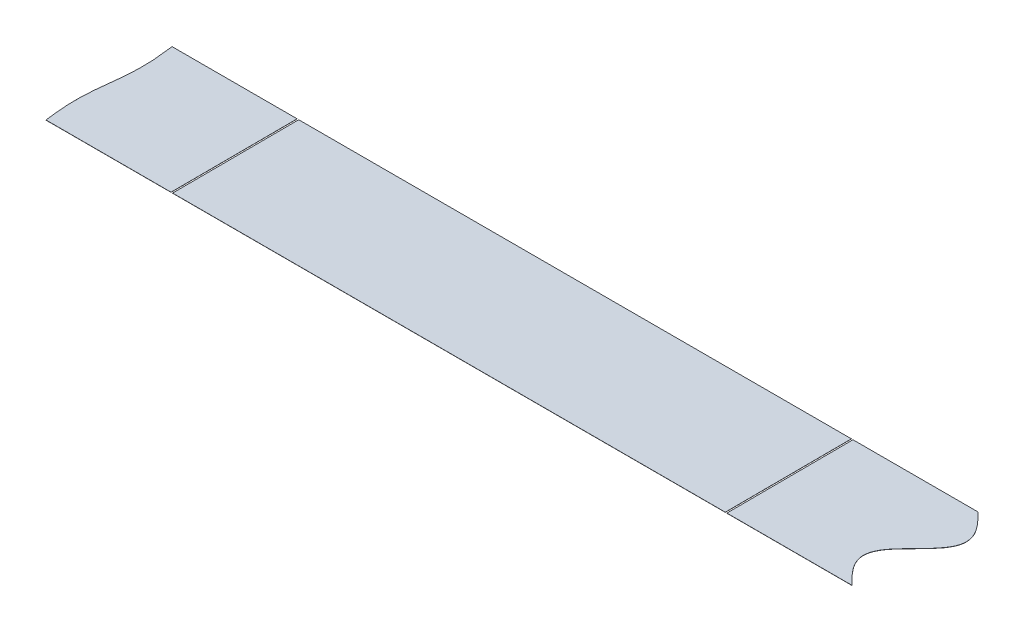
ISO-10303-21;
HEADER;
FILE_DESCRIPTION(('STEP AP214'),'2;1');
FILE_NAME('part.step','',(''),(''),'','','');
FILE_SCHEMA(('AUTOMOTIVE_DESIGN { 1 0 10303 214 1 1 1 1 }'));
ENDSEC;
DATA;
#1=APPLICATION_CONTEXT('core data for automotive mechanical design processes');
#2=APPLICATION_PROTOCOL_DEFINITION('international standard','automotive_design',2000,#1);
#3=PRODUCT_CONTEXT('',#1,'mechanical');
#4=PRODUCT('Part','Part','',(#3));
#5=PRODUCT_RELATED_PRODUCT_CATEGORY('part','',(#4));
#6=PRODUCT_DEFINITION_FORMATION('','',#4);
#7=PRODUCT_DEFINITION_CONTEXT('part definition',#1,'design');
#8=PRODUCT_DEFINITION('design','',#6,#7);
#9=PRODUCT_DEFINITION_SHAPE('','',#8);
#10=(LENGTH_UNIT() NAMED_UNIT(*) SI_UNIT(.MILLI.,.METRE.));
#11=(NAMED_UNIT(*) PLANE_ANGLE_UNIT() SI_UNIT($,.RADIAN.));
#12=(NAMED_UNIT(*) SI_UNIT($,.STERADIAN.) SOLID_ANGLE_UNIT());
#13=UNCERTAINTY_MEASURE_WITH_UNIT(LENGTH_MEASURE(1.E-05),#10,'distance_accuracy_value','');
#14=(GEOMETRIC_REPRESENTATION_CONTEXT(3) GLOBAL_UNCERTAINTY_ASSIGNED_CONTEXT((#13)) GLOBAL_UNIT_ASSIGNED_CONTEXT((#10,
#11,#12)) REPRESENTATION_CONTEXT('',''));
#15=CARTESIAN_POINT('',(0.,0.,0.));
#16=DIRECTION('',(0.,0.,1.));
#17=DIRECTION('',(1.,0.,0.));
#18=AXIS2_PLACEMENT_3D('',#15,#16,#17);
#19=CARTESIAN_POINT('',(7958.49039614374,401.836568244569,-4899.10644549594));
#20=DIRECTION('',(0.,0.999992126449225,0.00396825396825354));
#21=DIRECTION('',(0.,-0.00396825396825354,0.999992126449225));
#22=AXIS2_PLACEMENT_3D('',#19,#20,#21);
#23=PLANE('',#22);
#24=DIRECTION('',(0.,0.00396825396825362,-0.999992126449225));
#25=VECTOR('',#24,1.);
#26=CARTESIAN_POINT('',(2805.32798019281,381.699900005905,175.293996783698));
#27=LINE('',#26,#25);
#28=CARTESIAN_POINT('',(2805.32798019281,381.384892477941,254.675268813232));
#29=VERTEX_POINT('',#28);
#30=CARTESIAN_POINT('',(2805.32798019281,381.699900005905,175.293996783698));
#31=VERTEX_POINT('',#30);
#32=EDGE_CURVE('E14',#29,#31,#27,.T.);
#33=ORIENTED_EDGE('',*,*,#32,.F.);
#34=DIRECTION('',(-1.,0.,0.));
#35=VECTOR('',#34,1.);
#36=CARTESIAN_POINT('',(2883.95,381.384892477941,254.675268813232));
#37=LINE('',#36,#35);
#38=CARTESIAN_POINT('',(2883.95,381.384892477941,254.675268813232));
#39=VERTEX_POINT('',#38);
#40=EDGE_CURVE('E101',#39,#29,#37,.T.);
#41=ORIENTED_EDGE('',*,*,#40,.F.);
#42=CARTESIAN_POINT('',(2883.95,381.384892477941,254.675268813234));
#43=CARTESIAN_POINT('',(2883.55257564203,381.386475829465,254.276267370747));
#44=CARTESIAN_POINT('',(2883.33259255253,381.387353474253,254.055102625502));
#45=CARTESIAN_POINT('',(2882.99174945316,381.388713302277,253.712428661748));
#46=CARTESIAN_POINT('',(2882.38983360873,381.391123868475,253.104970762552));
#47=CARTESIAN_POINT('',(2881.78469414821,381.393562508902,252.490438213568));
#48=CARTESIAN_POINT('',(2881.18241221287,381.396010836879,251.873464421111));
#49=CARTESIAN_POINT('',(2880.58574930101,381.398463644581,251.255361747005));
#50=CARTESIAN_POINT('',(2879.9966565405,381.400918889008,250.636645022883));
#51=CARTESIAN_POINT('',(2879.41679462217,381.40337560637,250.017557122294));
#52=CARTESIAN_POINT('',(2878.84768882765,381.405833280432,249.398228134871));
#53=CARTESIAN_POINT('',(2878.29078382996,381.4082916109,248.778733734704));
#54=CARTESIAN_POINT('',(2877.4647372046,381.412029908794,247.836690082726));
#55=CARTESIAN_POINT('',(2876.44237493674,381.416939167796,246.599566554878));
#56=CARTESIAN_POINT('',(2875.49168991331,381.421851392,245.36169580179));
#57=CARTESIAN_POINT('',(2874.62209555102,381.426765518505,244.123345672821));
#58=CARTESIAN_POINT('',(2873.84211033941,381.431680925561,242.884672847575));
#59=CARTESIAN_POINT('',(2873.15932988044,381.436597223579,241.645775501689));
#60=CARTESIAN_POINT('',(2872.5803802896,381.441514152066,240.406719278881));
#61=CARTESIAN_POINT('',(2872.11086794387,381.446431527843,239.167550339685));
#62=CARTESIAN_POINT('',(2871.7553332312,381.451349215359,237.928302843083));
#63=CARTESIAN_POINT('',(2871.51721134919,381.45626710782,236.689003700585));
#64=CARTESIAN_POINT('',(2871.39880176862,381.4611851165,235.449675271261));
#65=CARTESIAN_POINT('',(2871.40124761538,381.466103162161,234.210337522822));
#66=CARTESIAN_POINT('',(2871.52452528862,381.471021167921,232.971009829249));
#67=CARTESIAN_POINT('',(2871.76744465254,381.475939053993,231.731712296829));
#68=CARTESIAN_POINT('',(2872.1276598483,381.480856730982,230.492467452854));
#69=CARTESIAN_POINT('',(2872.60169038202,381.485774091596,229.253302334983));
#70=CARTESIAN_POINT('',(2873.18495197861,381.490690998663,228.014251509896));
#71=CARTESIAN_POINT('',(2873.87179606582,381.495607266279,226.775361825264));
#72=CARTESIAN_POINT('',(2874.65555641018,381.500522630288,225.536699847697));
#73=CARTESIAN_POINT('',(2875.52859924595,381.505436694016,224.298365538339));
#74=CARTESIAN_POINT('',(2876.48236961234,381.51034882316,223.060518740289));
#75=CARTESIAN_POINT('',(2877.50741793725,381.515257929834,221.823433598835));
#76=CARTESIAN_POINT('',(2878.33531145958,381.518996632526,220.881287938635));
#77=CARTESIAN_POINT('',(2878.89325478949,381.521454917765,220.261804935868));
#78=CARTESIAN_POINT('',(2879.46328438493,381.523912527015,219.642492281146));
#79=CARTESIAN_POINT('',(2880.04395037151,381.526369148317,219.023428587266));
#80=CARTESIAN_POINT('',(2880.63371934904,381.528824241006,218.404750101033));
#81=CARTESIAN_POINT('',(2881.23091471381,381.531276784631,217.786713973566));
#82=CARTESIAN_POINT('',(2881.83354799713,381.533724593164,217.169871080034));
#83=CARTESIAN_POINT('',(2882.43873791292,381.536161986025,216.555652915144));
#84=CARTESIAN_POINT('',(2883.03978867811,381.538568130556,215.949309267544));
#85=CARTESIAN_POINT('',(2883.5196063682,381.540482024532,215.467011783078));
#86=CARTESIAN_POINT('',(2883.79407188063,381.54157582409,215.191376464671));
#87=CARTESIAN_POINT('',(2884.20587846356,381.543216461928,214.777938984717));
#88=CARTESIAN_POINT('',(2884.48032488711,381.544310185254,214.5023228765));
#89=CARTESIAN_POINT('',(2884.96014399032,381.546224084349,214.020024102206));
#90=CARTESIAN_POINT('',(2885.56119254847,381.54863021872,213.413683014635));
#91=CARTESIAN_POINT('',(2886.16638266252,381.551067610333,212.7994651643));
#92=CARTESIAN_POINT('',(2886.76901695397,381.553515420245,212.182621923431));
#93=CARTESIAN_POINT('',(2887.36621296051,381.555967963085,211.564585993827));
#94=CARTESIAN_POINT('',(2887.95598267922,381.558423054693,210.94590777972));
#95=CARTESIAN_POINT('',(2888.53664981512,381.560879675933,210.326844101692));
#96=CARTESIAN_POINT('',(2889.10668086557,381.563337285764,209.707531300309));
#97=CARTESIAN_POINT('',(2889.66462563815,381.565795570877,209.08804832949));
#98=CARTESIAN_POINT('',(2890.49252173042,381.569534274,208.145902560522));
#99=CARTESIAN_POINT('',(2891.51757381741,381.574443380382,206.908817492688));
#100=CARTESIAN_POINT('',(2892.47134843065,381.579355508856,205.670970863626));
#101=CARTESIAN_POINT('',(2893.34439612496,381.584269572406,204.432636598994));
#102=CARTESIAN_POINT('',(2894.12816185949,381.58918493672,203.193974544659));
#103=CARTESIAN_POINT('',(2894.81501170623,381.594101204485,201.955084822412));
#104=CARTESIAN_POINT('',(2895.39827935469,381.599018111242,200.716034075494));
#105=CARTESIAN_POINT('',(2895.87231627679,381.60393547182,199.476868966495));
#106=CARTESIAN_POINT('',(2896.2325381032,381.608853149089,198.237624052067));
#107=CARTESIAN_POINT('',(2896.47546424256,381.613771035197,196.998326510772));
#108=CARTESIAN_POINT('',(2896.59874878406,381.618689040699,195.758998882143));
#109=CARTESIAN_POINT('',(2896.59999999916,381.62119785213,195.126783379276));
#110=CARTESIAN_POINT('',(2896.60000003873,381.623703634443,194.495331208398));
#111=CARTESIAN_POINT('',(2896.47946141937,381.628615423202,193.257570186557));
#112=CARTESIAN_POINT('',(2896.239544813,381.633527094968,192.019838646977));
#113=CARTESIAN_POINT('',(2895.88256116492,381.638438561022,190.782158946528));
#114=CARTESIAN_POINT('',(2895.4119509296,381.643349715105,189.544557861854));
#115=CARTESIAN_POINT('',(2894.83225358092,381.648260422016,188.307069463756));
#116=CARTESIAN_POINT('',(2894.14906858858,381.65317049868,187.069739886676));
#117=CARTESIAN_POINT('',(2893.36900924114,381.658079685281,185.832634603757));
#118=CARTESIAN_POINT('',(2892.4996528331,381.662987592355,184.595851759245));
#119=CARTESIAN_POINT('',(2891.54949413842,381.667893599561,183.359547677288));
#120=CARTESIAN_POINT('',(2890.52791793694,381.672796645766,182.123989762065));
#121=CARTESIAN_POINT('',(2889.70264097854,381.676530223398,181.18313560676));
#122=CARTESIAN_POINT('',(2889.14629439731,381.67898544115,180.564425604603));
#123=CARTESIAN_POINT('',(2888.57779269112,381.68144000252,179.945881009492));
#124=CARTESIAN_POINT('',(2887.99857532044,381.683893608502,179.327577170563));
#125=CARTESIAN_POINT('',(2887.41016194525,381.686345745056,178.709643624284));
#126=CARTESIAN_POINT('',(2886.81420830317,381.688795447175,178.092323550658));
#127=CARTESIAN_POINT('',(2886.21265937371,381.691240675138,177.476130955669));
#128=CARTESIAN_POINT('',(2885.60826891301,381.693676230259,176.862375897813));
#129=CARTESIAN_POINT('',(2885.00710529599,381.696083754725,176.25568450903));
#130=CARTESIAN_POINT('',(2884.66662621499,381.697442126394,175.913377543671));
#131=CARTESIAN_POINT('',(2884.4469524093,381.69831853464,175.692524404705));
#132=CARTESIAN_POINT('',(2884.05,381.699900005905,175.293996783699));
#133=B_SPLINE_CURVE_WITH_KNOTS('',2,(#42,#43,#44,#45,#46,#47,#48,#49,#50,#51,#52,#53,#54,#55,
#56,#57,#58,#59,#60,#61,#62,#63,#64,#65,#66,#67,#68,#69,#70,#71,#72,#73,#74,#75,#76,#77,#78,#79,
#80,#81,#82,#83,#84,#85,#86,#87,#88,#89,#90,#91,#92,#93,#94,#95,#96,#97,#98,#99,#100,#101,#102,
#103,#104,#105,#106,#107,#108,#109,#110,#111,#112,#113,#114,#115,#116,#117,#118,#119,#120,#121,
#122,#123,#124,#125,#126,#127,#128,#129,#130,#131,#132),.UNSPECIFIED.,.F.,.F.,(3,2,1,1,1,1,1,1,
1,1,1,1,1,1,1,1,1,1,1,1,1,1,1,1,1,1,1,1,1,1,1,1,1,1,1,1,1,1,1,1,1,1,1,1,1,1,1,1,1,1,1,1,1,1,1,1,
1,1,1,1,1,1,1,1,1,1,1,1,1,1,1,1,1,1,1,1,1,1,1,1,1,1,1,1,1,1,2,3),(0.,0.0078125,0.015625,
0.0234375,0.03125,0.0390625,0.046875,0.0546875,0.0625,0.0703125,0.078125,0.09375,0.109375,0.125,
0.140625,0.15625,0.171875,0.1875,0.203125,0.21875,0.234375,0.25,0.265625,0.28125,0.296875,
0.3125,0.328125,0.34375,0.359375,0.375,0.390625,0.40625,0.421875,0.4296875,0.4375,0.4453125,
0.453125,0.4609375,0.46875,0.4765625,0.484375,0.4921875,0.49609375,0.5,0.50390625,0.5078125,
0.515625,0.5234375,0.53125,0.5390625,0.546875,0.5546875,0.5625,0.5703125,0.578125,0.59375,
0.609375,0.625,0.640625,0.65625,0.671875,0.6875,0.703125,0.71875,0.734375,0.75,
0.750316619873047,0.765921831130981,0.781527042388916,0.797132253646851,0.812737464904785,
0.82834267616272,0.843947887420654,0.859553098678589,0.875158309936523,0.890763521194458,
0.906368732452393,0.921973943710327,0.929776549339294,0.937579154968262,0.945381760597229,
0.953184366226196,0.960986971855164,0.968789577484131,0.976592183113098,0.984394788742065,
0.992197394371033,1.),.UNSPECIFIED.);
#134=CARTESIAN_POINT('',(2884.05,381.699900005905,175.293996783698));
#135=VERTEX_POINT('',#134);
#136=EDGE_CURVE('E122',#39,#135,#133,.T.);
#137=ORIENTED_EDGE('',*,*,#136,.T.);
#138=DIRECTION('',(-1.,0.,0.));
#139=VECTOR('',#138,1.);
#140=CARTESIAN_POINT('',(2884.05,381.699900005905,175.293996783698));
#141=LINE('',#140,#139);
#142=EDGE_CURVE('E103',#135,#31,#141,.T.);
#143=ORIENTED_EDGE('',*,*,#142,.T.);
#144=EDGE_LOOP('',(#33,#41,#137,#143));
#145=FACE_BOUND('',#144,.T.);
#146=ADVANCED_FACE('F55',(#145),#23,.T.);
#147=CARTESIAN_POINT('',(7958.49039614374,401.736569031924,-4899.10684232133));
#148=DIRECTION('',(0.,0.999992126449225,0.00396825396825354));
#149=DIRECTION('',(0.,-0.00396825396825354,0.999992126449225));
#150=AXIS2_PLACEMENT_3D('',#147,#148,#149);
#151=PLANE('',#150);
#152=DIRECTION('',(-1.,0.,0.));
#153=VECTOR('',#152,1.);
#154=CARTESIAN_POINT('',(2883.95,381.284893265296,254.674871987835));
#155=LINE('',#154,#153);
#156=CARTESIAN_POINT('',(2883.95,381.284893265296,254.674871987835));
#157=VERTEX_POINT('',#156);
#158=CARTESIAN_POINT('',(2805.32798019281,381.284893265296,254.674871987835));
#159=VERTEX_POINT('',#158);
#160=EDGE_CURVE('E58',#157,#159,#155,.T.);
#161=ORIENTED_EDGE('',*,*,#160,.T.);
#162=DIRECTION('',(0.,0.00396825396825354,-0.999992126449225));
#163=VECTOR('',#162,1.);
#164=CARTESIAN_POINT('',(2805.32798019281,401.736569031924,-4899.10684232133));
#165=LINE('',#164,#163);
#166=CARTESIAN_POINT('',(2805.32798019281,381.59990079326,175.293599958301));
#167=VERTEX_POINT('',#166);
#168=EDGE_CURVE('E73',#159,#167,#165,.T.);
#169=ORIENTED_EDGE('',*,*,#168,.T.);
#170=DIRECTION('',(-1.,0.,0.));
#171=VECTOR('',#170,1.);
#172=CARTESIAN_POINT('',(2884.05,381.59990079326,175.293599958301));
#173=LINE('',#172,#171);
#174=CARTESIAN_POINT('',(2884.05,381.59990079326,175.293599958301));
#175=VERTEX_POINT('',#174);
#176=EDGE_CURVE('E114',#175,#167,#173,.T.);
#177=ORIENTED_EDGE('',*,*,#176,.F.);
#178=CARTESIAN_POINT('',(2883.95,381.284893265296,254.674871987837));
#179=CARTESIAN_POINT('',(2883.55257564203,381.28647661682,254.27587054535));
#180=CARTESIAN_POINT('',(2883.33259255253,381.287354261608,254.054705800105));
#181=CARTESIAN_POINT('',(2882.99174945316,381.288714089632,253.712031836351));
#182=CARTESIAN_POINT('',(2882.38983360873,381.29112465583,253.104573937155));
#183=CARTESIAN_POINT('',(2881.78469414821,381.293563296257,252.490041388171));
#184=CARTESIAN_POINT('',(2881.18241221287,381.296011624234,251.873067595715));
#185=CARTESIAN_POINT('',(2880.58574930101,381.298464431936,251.254964921608));
#186=CARTESIAN_POINT('',(2879.9966565405,381.300919676363,250.636248197486));
#187=CARTESIAN_POINT('',(2879.41679462217,381.303376393725,250.017160296897));
#188=CARTESIAN_POINT('',(2878.84768882765,381.305834067787,249.397831309474));
#189=CARTESIAN_POINT('',(2878.29078382996,381.308292398255,248.778336909307));
#190=CARTESIAN_POINT('',(2877.4647372046,381.312030696149,247.836293257329));
#191=CARTESIAN_POINT('',(2876.44237493674,381.316939955151,246.599169729481));
#192=CARTESIAN_POINT('',(2875.49168991331,381.321852179355,245.361298976393));
#193=CARTESIAN_POINT('',(2874.62209555102,381.32676630586,244.122948847424));
#194=CARTESIAN_POINT('',(2873.84211033941,381.331681712916,242.884276022179));
#195=CARTESIAN_POINT('',(2873.15932988044,381.336598010934,241.645378676292));
#196=CARTESIAN_POINT('',(2872.5803802896,381.341514939421,240.406322453484));
#197=CARTESIAN_POINT('',(2872.11086794387,381.346432315198,239.167153514289));
#198=CARTESIAN_POINT('',(2871.7553332312,381.351350002714,237.927906017687));
#199=CARTESIAN_POINT('',(2871.51721134919,381.356267895175,236.688606875188));
#200=CARTESIAN_POINT('',(2871.39880176862,381.361185903855,235.449278445864));
#201=CARTESIAN_POINT('',(2871.40124761538,381.366103949516,234.209940697425));
#202=CARTESIAN_POINT('',(2871.52452528862,381.371021955276,232.970613003852));
#203=CARTESIAN_POINT('',(2871.76744465254,381.375939841348,231.731315471432));
#204=CARTESIAN_POINT('',(2872.1276598483,381.380857518337,230.492070627457));
#205=CARTESIAN_POINT('',(2872.60169038202,381.385774878951,229.252905509586));
#206=CARTESIAN_POINT('',(2873.18495197861,381.390691786018,228.013854684499));
#207=CARTESIAN_POINT('',(2873.87179606582,381.395608053634,226.774964999867));
#208=CARTESIAN_POINT('',(2874.65555641018,381.400523417643,225.536303022301));
#209=CARTESIAN_POINT('',(2875.52859924595,381.405437481371,224.297968712942));
#210=CARTESIAN_POINT('',(2876.48236961234,381.410349610515,223.060121914892));
#211=CARTESIAN_POINT('',(2877.50741793725,381.415258717189,221.823036773438));
#212=CARTESIAN_POINT('',(2878.33531145958,381.418997419881,220.880891113239));
#213=CARTESIAN_POINT('',(2878.89325478949,381.42145570512,220.261408110471));
#214=CARTESIAN_POINT('',(2879.46328438493,381.42391331437,219.642095455749));
#215=CARTESIAN_POINT('',(2880.04395037151,381.426369935672,219.02303176187));
#216=CARTESIAN_POINT('',(2880.63371934904,381.428825028361,218.404353275636));
#217=CARTESIAN_POINT('',(2881.23091471381,381.431277571986,217.786317148169));
#218=CARTESIAN_POINT('',(2881.83354799713,381.433725380519,217.169474254638));
#219=CARTESIAN_POINT('',(2882.43873791292,381.43616277338,216.555256089747));
#220=CARTESIAN_POINT('',(2883.03978867811,381.438568917911,215.948912442147));
#221=CARTESIAN_POINT('',(2883.5196063682,381.440482811887,215.466614957681));
#222=CARTESIAN_POINT('',(2883.79407188063,381.441576611445,215.190979639274));
#223=CARTESIAN_POINT('',(2884.20587846356,381.443217249283,214.77754215932));
#224=CARTESIAN_POINT('',(2884.48032488711,381.44431097261,214.501926051104));
#225=CARTESIAN_POINT('',(2884.96014399032,381.446224871704,214.01962727681));
#226=CARTESIAN_POINT('',(2885.56119254847,381.448631006075,213.413286189239));
#227=CARTESIAN_POINT('',(2886.16638266252,381.451068397688,212.799068338903));
#228=CARTESIAN_POINT('',(2886.76901695397,381.4535162076,212.182225098034));
#229=CARTESIAN_POINT('',(2887.36621296051,381.45596875044,211.56418916843));
#230=CARTESIAN_POINT('',(2887.95598267922,381.458423842048,210.945510954323));
#231=CARTESIAN_POINT('',(2888.53664981512,381.460880463288,210.326447276295));
#232=CARTESIAN_POINT('',(2889.10668086557,381.46333807312,209.707134474912));
#233=CARTESIAN_POINT('',(2889.66462563815,381.465796358232,209.087651504094));
#234=CARTESIAN_POINT('',(2890.49252173042,381.469535061355,208.145505735125));
#235=CARTESIAN_POINT('',(2891.51757381741,381.474444167737,206.908420667292));
#236=CARTESIAN_POINT('',(2892.47134843065,381.479356296211,205.670574038229));
#237=CARTESIAN_POINT('',(2893.34439612496,381.484270359762,204.432239773597));
#238=CARTESIAN_POINT('',(2894.12816185949,381.489185724075,203.193577719262));
#239=CARTESIAN_POINT('',(2894.81501170623,381.49410199184,201.954687997016));
#240=CARTESIAN_POINT('',(2895.39827935469,381.499018898597,200.715637250097));
#241=CARTESIAN_POINT('',(2895.87231627679,381.503936259175,199.476472141098));
#242=CARTESIAN_POINT('',(2896.2325381032,381.508853936444,198.23722722667));
#243=CARTESIAN_POINT('',(2896.47546424256,381.513771822552,196.997929685375));
#244=CARTESIAN_POINT('',(2896.59874878406,381.518689828054,195.758602056746));
#245=CARTESIAN_POINT('',(2896.59999999916,381.521198639485,195.126386553879));
#246=CARTESIAN_POINT('',(2896.60000003873,381.523704421798,194.494934383001));
#247=CARTESIAN_POINT('',(2896.47946141937,381.528616210558,193.25717336116));
#248=CARTESIAN_POINT('',(2896.239544813,381.533527882323,192.01944182158));
#249=CARTESIAN_POINT('',(2895.88256116492,381.538439348377,190.781762121131));
#250=CARTESIAN_POINT('',(2895.4119509296,381.54335050246,189.544161036457));
#251=CARTESIAN_POINT('',(2894.83225358092,381.548261209372,188.306672638359));
#252=CARTESIAN_POINT('',(2894.14906858858,381.553171286036,187.069343061279));
#253=CARTESIAN_POINT('',(2893.36900924114,381.558080472636,185.83223777836));
#254=CARTESIAN_POINT('',(2892.4996528331,381.56298837971,184.595454933849));
#255=CARTESIAN_POINT('',(2891.54949413842,381.567894386917,183.359150851891));
#256=CARTESIAN_POINT('',(2890.52791793694,381.572797433121,182.123592936668));
#257=CARTESIAN_POINT('',(2889.70264097854,381.576531010753,181.182738781363));
#258=CARTESIAN_POINT('',(2889.14629439731,381.578986228505,180.564028779206));
#259=CARTESIAN_POINT('',(2888.57779269112,381.581440789876,179.945484184096));
#260=CARTESIAN_POINT('',(2887.99857532044,381.583894395857,179.327180345166));
#261=CARTESIAN_POINT('',(2887.41016194525,381.586346532411,178.709246798888));
#262=CARTESIAN_POINT('',(2886.81420830317,381.58879623453,178.091926725261));
#263=CARTESIAN_POINT('',(2886.21265937371,381.591241462493,177.475734130272));
#264=CARTESIAN_POINT('',(2885.60826891301,381.593677017614,176.861979072417));
#265=CARTESIAN_POINT('',(2885.00710529599,381.596084542081,176.255287683633));
#266=CARTESIAN_POINT('',(2884.66662621499,381.597442913749,175.912980718274));
#267=CARTESIAN_POINT('',(2884.4469524093,381.598319321995,175.692127579309));
#268=CARTESIAN_POINT('',(2884.05,381.59990079326,175.293599958303));
#269=B_SPLINE_CURVE_WITH_KNOTS('',2,(#178,#179,#180,#181,#182,#183,#184,#185,#186,#187,#188,
#189,#190,#191,#192,#193,#194,#195,#196,#197,#198,#199,#200,#201,#202,#203,#204,#205,#206,#207,
#208,#209,#210,#211,#212,#213,#214,#215,#216,#217,#218,#219,#220,#221,#222,#223,#224,#225,#226,
#227,#228,#229,#230,#231,#232,#233,#234,#235,#236,#237,#238,#239,#240,#241,#242,#243,#244,#245,
#246,#247,#248,#249,#250,#251,#252,#253,#254,#255,#256,#257,#258,#259,#260,#261,#262,#263,#264,
#265,#266,#267,#268),.UNSPECIFIED.,.F.,.F.,(3,2,1,1,1,1,1,1,1,1,1,1,1,1,1,1,1,1,1,1,1,1,1,1,1,1,
1,1,1,1,1,1,1,1,1,1,1,1,1,1,1,1,1,1,1,1,1,1,1,1,1,1,1,1,1,1,1,1,1,1,1,1,1,1,1,1,1,1,1,1,1,1,1,1,
1,1,1,1,1,1,1,1,1,1,1,1,2,3),(0.,0.0078125,0.015625,0.0234375,0.03125,0.0390625,0.046875,
0.0546875,0.0625,0.0703125,0.078125,0.09375,0.109375,0.125,0.140625,0.15625,0.171875,0.1875,
0.203125,0.21875,0.234375,0.25,0.265625,0.28125,0.296875,0.3125,0.328125,0.34375,0.359375,0.375,
0.390625,0.40625,0.421875,0.4296875,0.4375,0.4453125,0.453125,0.4609375,0.46875,0.4765625,
0.484375,0.4921875,0.49609375,0.5,0.50390625,0.5078125,0.515625,0.5234375,0.53125,0.5390625,
0.546875,0.5546875,0.5625,0.5703125,0.578125,0.59375,0.609375,0.625,0.640625,0.65625,0.671875,
0.6875,0.703125,0.71875,0.734375,0.75,0.750316619873047,0.765921831130981,0.781527042388916,
0.797132253646851,0.812737464904785,0.82834267616272,0.843947887420654,0.859553098678589,
0.875158309936523,0.890763521194458,0.906368732452393,0.921973943710327,0.929776549339294,
0.937579154968262,0.945381760597229,0.953184366226196,0.960986971855164,0.968789577484131,
0.976592183113098,0.984394788742065,0.992197394371033,1.),.UNSPECIFIED.);
#270=EDGE_CURVE('E106',#157,#175,#269,.T.);
#271=ORIENTED_EDGE('',*,*,#270,.F.);
#272=EDGE_LOOP('',(#161,#169,#177,#271));
#273=FACE_BOUND('',#272,.T.);
#274=ADVANCED_FACE('F142',(#273),#151,.F.);
#275=CARTESIAN_POINT('',(2884.05,381.699900005905,175.293996783698));
#276=DIRECTION('',(0.,-0.00396825396825353,0.999992126449225));
#277=DIRECTION('',(0.,-0.999992126449225,-0.00396825396825353));
#278=AXIS2_PLACEMENT_3D('',#275,#276,#277);
#279=PLANE('',#278);
#280=ORIENTED_EDGE('',*,*,#176,.T.);
#281=DIRECTION('',(0.,0.999992126449225,0.00396825396825354));
#282=VECTOR('',#281,1.);
#283=CARTESIAN_POINT('',(2805.32798019281,371.699978741413,175.254314244016));
#284=LINE('',#283,#282);
#285=EDGE_CURVE('E111',#167,#31,#284,.T.);
#286=ORIENTED_EDGE('',*,*,#285,.T.);
#287=ORIENTED_EDGE('',*,*,#142,.F.);
#288=DIRECTION('',(0.,-0.999992126449225,-0.00396825396825353));
#289=VECTOR('',#288,1.);
#290=CARTESIAN_POINT('',(2884.05,381.699900005905,175.293996783698));
#291=LINE('',#290,#289);
#292=EDGE_CURVE('E107',#135,#175,#291,.T.);
#293=ORIENTED_EDGE('',*,*,#292,.T.);
#294=EDGE_LOOP('',(#280,#286,#287,#293));
#295=FACE_BOUND('',#294,.T.);
#296=ADVANCED_FACE('F140',(#295),#279,.F.);
#297=CARTESIAN_POINT('',(2883.95,381.384892477941,254.675268813232));
#298=DIRECTION('',(0.,-0.00396825396825353,0.999992126449225));
#299=DIRECTION('',(0.,-0.999992126449225,-0.00396825396825353));
#300=AXIS2_PLACEMENT_3D('',#297,#298,#299);
#301=PLANE('',#300);
#302=DIRECTION('',(0.,0.999992126449225,0.00396825396825353));
#303=VECTOR('',#302,1.);
#304=CARTESIAN_POINT('',(2805.32798019281,381.384892477941,254.675268813232));
#305=LINE('',#304,#303);
#306=EDGE_CURVE('E64',#159,#29,#305,.T.);
#307=ORIENTED_EDGE('',*,*,#306,.F.);
#308=ORIENTED_EDGE('',*,*,#160,.F.);
#309=DIRECTION('',(0.,-0.999992126449225,-0.00396825396825353));
#310=VECTOR('',#309,1.);
#311=CARTESIAN_POINT('',(2883.95,381.384892477941,254.675268813232));
#312=LINE('',#311,#310);
#313=EDGE_CURVE('E96',#39,#157,#312,.T.);
#314=ORIENTED_EDGE('',*,*,#313,.F.);
#315=ORIENTED_EDGE('',*,*,#40,.T.);
#316=EDGE_LOOP('',(#307,#308,#314,#315));
#317=FACE_BOUND('',#316,.T.);
#318=ADVANCED_FACE('F104',(#317),#301,.T.);
#319=DIRECTION('',(0.,-0.999992126449225,-0.00396825396825353));
#320=VECTOR('',#319,1.);
#321=SURFACE_OF_LINEAR_EXTRUSION('',#133,#320);
#322=ORIENTED_EDGE('',*,*,#270,.T.);
#323=ORIENTED_EDGE('',*,*,#292,.F.);
#324=ORIENTED_EDGE('',*,*,#136,.F.);
#325=ORIENTED_EDGE('',*,*,#313,.T.);
#326=EDGE_LOOP('',(#322,#323,#324,#325));
#327=FACE_BOUND('',#326,.T.);
#328=ADVANCED_FACE('F132',(#327),#321,.F.);
#329=CARTESIAN_POINT('',(2805.32798019281,371.699978741413,175.254314244016));
#330=DIRECTION('',(1.,0.,0.));
#331=DIRECTION('',(0.,0.,-1.));
#332=AXIS2_PLACEMENT_3D('',#329,#330,#331);
#333=PLANE('',#332);
#334=ORIENTED_EDGE('',*,*,#306,.T.);
#335=ORIENTED_EDGE('',*,*,#32,.T.);
#336=ORIENTED_EDGE('',*,*,#285,.F.);
#337=ORIENTED_EDGE('',*,*,#168,.F.);
#338=EDGE_LOOP('',(#334,#335,#336,#337));
#339=FACE_BOUND('',#338,.T.);
#340=ADVANCED_FACE('F91',(#339),#333,.F.);
#341=CLOSED_SHELL('',(#146,#274,#296,#318,#328,#340));
#342=MANIFOLD_SOLID_BREP('B2',#341);
#343=CARTESIAN_POINT('',(2883.95,381.384892477941,254.675268813232));
#344=DIRECTION('',(0.,-0.00396825396825353,0.999992126449225));
#345=DIRECTION('',(0.,-0.999992126449225,-0.00396825396825353));
#346=AXIS2_PLACEMENT_3D('',#343,#344,#345);
#347=PLANE('',#346);
#348=DIRECTION('',(0.,0.999992126449225,0.00396825396825354));
#349=VECTOR('',#348,1.);
#350=CARTESIAN_POINT('',(2455.32798019281,371.384971213449,254.63558627355));
#351=LINE('',#350,#349);
#352=CARTESIAN_POINT('',(2455.32798019281,381.284893265296,254.674871987835));
#353=VERTEX_POINT('',#352);
#354=CARTESIAN_POINT('',(2455.32798019281,381.384892477941,254.675268813232));
#355=VERTEX_POINT('',#354);
#356=EDGE_CURVE('E247',#353,#355,#351,.T.);
#357=ORIENTED_EDGE('',*,*,#356,.T.);
#358=DIRECTION('',(-1.,0.,0.));
#359=VECTOR('',#358,1.);
#360=CARTESIAN_POINT('',(2883.95,381.384892477941,254.675268813232));
#361=LINE('',#360,#359);
#362=CARTESIAN_POINT('',(2376.59403961437,381.384892477941,254.675268813234));
#363=VERTEX_POINT('',#362);
#364=EDGE_CURVE('E242',#355,#363,#361,.T.);
#365=ORIENTED_EDGE('',*,*,#364,.T.);
#366=DIRECTION('',(0.,-0.999992126449225,-0.00396825396825353));
#367=VECTOR('',#366,1.);
#368=CARTESIAN_POINT('',(2376.59403961437,381.384892477941,254.675268813234));
#369=LINE('',#368,#367);
#370=CARTESIAN_POINT('',(2376.59403961437,381.284893265296,254.674871987837));
#371=VERTEX_POINT('',#370);
#372=EDGE_CURVE('E245',#363,#371,#369,.T.);
#373=ORIENTED_EDGE('',*,*,#372,.T.);
#374=DIRECTION('',(-1.,0.,0.));
#375=VECTOR('',#374,1.);
#376=CARTESIAN_POINT('',(2883.95,381.284893265296,254.674871987835));
#377=LINE('',#376,#375);
#378=EDGE_CURVE('E203',#353,#371,#377,.T.);
#379=ORIENTED_EDGE('',*,*,#378,.F.);
#380=EDGE_LOOP('',(#357,#365,#373,#379));
#381=FACE_BOUND('',#380,.T.);
#382=ADVANCED_FACE('F200',(#381),#347,.T.);
#383=CARTESIAN_POINT('',(2884.05,381.699900005905,175.293996783698));
#384=DIRECTION('',(0.,-0.00396825396825353,0.999992126449225));
#385=DIRECTION('',(0.,-0.999992126449225,-0.00396825396825353));
#386=AXIS2_PLACEMENT_3D('',#383,#384,#385);
#387=PLANE('',#386);
#388=DIRECTION('',(-1.,0.,0.));
#389=VECTOR('',#388,1.);
#390=CARTESIAN_POINT('',(2884.05,381.699900005905,175.293996783698));
#391=LINE('',#390,#389);
#392=CARTESIAN_POINT('',(2455.32798019281,381.699900005905,175.293996783698));
#393=VERTEX_POINT('',#392);
#394=CARTESIAN_POINT('',(2376.60596038562,381.699900005905,175.293996783698));
#395=VERTEX_POINT('',#394);
#396=EDGE_CURVE('E254',#393,#395,#391,.T.);
#397=ORIENTED_EDGE('',*,*,#396,.F.);
#398=DIRECTION('',(0.,0.999992126449225,0.00396825396825354));
#399=VECTOR('',#398,1.);
#400=CARTESIAN_POINT('',(2455.32798019281,371.699978741413,175.254314244016));
#401=LINE('',#400,#399);
#402=CARTESIAN_POINT('',(2455.32798019281,381.59990079326,175.293599958301));
#403=VERTEX_POINT('',#402);
#404=EDGE_CURVE('E209',#403,#393,#401,.T.);
#405=ORIENTED_EDGE('',*,*,#404,.F.);
#406=DIRECTION('',(-1.,0.,0.));
#407=VECTOR('',#406,1.);
#408=CARTESIAN_POINT('',(2884.05,381.59990079326,175.293599958301));
#409=LINE('',#408,#407);
#410=CARTESIAN_POINT('',(2376.60596038562,381.59990079326,175.293599958301));
#411=VERTEX_POINT('',#410);
#412=EDGE_CURVE('E261',#403,#411,#409,.T.);
#413=ORIENTED_EDGE('',*,*,#412,.T.);
#414=DIRECTION('',(0.,-0.999992126449225,-0.00396825396825353));
#415=VECTOR('',#414,1.);
#416=CARTESIAN_POINT('',(2376.60596038562,381.699900005905,175.293996783698));
#417=LINE('',#416,#415);
#418=EDGE_CURVE('E265',#395,#411,#417,.T.);
#419=ORIENTED_EDGE('',*,*,#418,.F.);
#420=EDGE_LOOP('',(#397,#405,#413,#419));
#421=FACE_BOUND('',#420,.T.);
#422=ADVANCED_FACE('F289',(#421),#387,.F.);
#423=CARTESIAN_POINT('',(7958.49039614374,401.836568244569,-4899.10644549594));
#424=DIRECTION('',(0.,0.999992126449225,0.00396825396825354));
#425=DIRECTION('',(0.,-0.00396825396825354,0.999992126449225));
#426=AXIS2_PLACEMENT_3D('',#423,#424,#425);
#427=PLANE('',#426);
#428=DIRECTION('',(0.,-0.00396825396825362,0.999992126449225));
#429=VECTOR('',#428,1.);
#430=CARTESIAN_POINT('',(2455.32798019281,381.699900005905,175.293996783698));
#431=LINE('',#430,#429);
#432=EDGE_CURVE('E53',#393,#355,#431,.T.);
#433=ORIENTED_EDGE('',*,*,#432,.F.);
#434=ORIENTED_EDGE('',*,*,#396,.T.);
#435=CARTESIAN_POINT('',(2376.60596038562,381.699900005905,175.293996783699));
#436=CARTESIAN_POINT('',(2376.65333622061,381.698316661476,175.692996438208));
#437=CARTESIAN_POINT('',(2376.67956011513,381.697439009593,175.914162971431));
#438=CARTESIAN_POINT('',(2376.72018955605,381.696079238057,176.256822700577));
#439=CARTESIAN_POINT('',(2376.83408340741,381.692252936803,177.221043024584));
#440=CARTESIAN_POINT('',(2376.89850748117,381.690056020656,177.774661534622));
#441=CARTESIAN_POINT('',(2376.97530687122,381.687437095614,178.434625448907));
#442=CARTESIAN_POINT('',(2377.11474196713,381.682562050428,179.663127162982));
#443=CARTESIAN_POINT('',(2377.24986711722,381.677666935342,180.896686452225));
#444=CARTESIAN_POINT('',(2377.37905229998,381.672762630845,182.132561454737));
#445=CARTESIAN_POINT('',(2377.50092586914,381.667853371338,183.369685109863));
#446=CARTESIAN_POINT('',(2377.61425496417,381.662941146983,184.607555900792));
#447=CARTESIAN_POINT('',(2377.71791742116,381.658027020991,185.845905900285));
#448=CARTESIAN_POINT('',(2377.81089778462,381.653111614926,187.084578476084));
#449=CARTESIAN_POINT('',(2377.93405300352,381.645672781248,188.959149803063));
#450=CARTESIAN_POINT('',(2378.04538775636,381.635891143882,191.424103011375));
#451=CARTESIAN_POINT('',(2378.10201707878,381.626129296507,193.884069180915));
#452=CARTESIAN_POINT('',(2378.10201717882,381.621198039325,195.126736206675));
#453=CARTESIAN_POINT('',(2378.10172355544,381.616242484573,196.375526171609));
#454=CARTESIAN_POINT('',(2378.04395385889,381.606431455964,198.847885914581));
#455=CARTESIAN_POINT('',(2377.93125908954,381.596624679265,201.319174184737));
#456=CARTESIAN_POINT('',(2377.80736101087,381.589185272891,203.193889830269));
#457=CARTESIAN_POINT('',(2377.71393088547,381.584269910289,204.432551453163));
#458=CARTESIAN_POINT('',(2377.60985757682,381.579355847051,205.670885639035));
#459=CARTESIAN_POINT('',(2377.4961608712,381.574443716756,206.908732727142));
#460=CARTESIAN_POINT('',(2377.37396726277,381.569534608746,208.145818205379));
#461=CARTESIAN_POINT('',(2377.24451448107,381.564630571875,209.381625766614));
#462=CARTESIAN_POINT('',(2377.10918110764,381.559735983384,210.615052354815));
#463=CARTESIAN_POINT('',(2376.96961392852,381.554862213009,211.843232818916));
#464=CARTESIAN_POINT('',(2376.89266363877,381.552240227172,212.503968047543));
#465=CARTESIAN_POINT('',(2376.82841213945,381.550050936894,213.055664853764));
#466=CARTESIAN_POINT('',(2376.7144663476,381.546224412017,214.019941530423));
#467=CARTESIAN_POINT('',(2376.67360747048,381.544857238235,214.364466610735));
#468=CARTESIAN_POINT('',(2376.64909359192,381.544036982408,214.571169451751));
#469=CARTESIAN_POINT('',(2376.55091487264,381.54075578433,215.398024857159));
#470=CARTESIAN_POINT('',(2376.52639252951,381.539935245611,215.604798986196));
#471=CARTESIAN_POINT('',(2376.48554551609,381.538568469366,215.949223888062));
#472=CARTESIAN_POINT('',(2376.3715992853,381.53474193279,216.913503512858));
#473=CARTESIAN_POINT('',(2376.30733636123,381.532552256674,217.465297549389));
#474=CARTESIAN_POINT('',(2376.23039746515,381.529930663189,218.125933906172));
#475=CARTESIAN_POINT('',(2376.09082999392,381.525056894314,219.354113992474));
#476=CARTESIAN_POINT('',(2375.95549609121,381.520162302641,220.587541382555));
#477=CARTESIAN_POINT('',(2375.82604274327,381.515258264627,221.823349231785));
#478=CARTESIAN_POINT('',(2375.70384855893,381.510349159041,223.060434099135));
#479=CARTESIAN_POINT('',(2375.59015117684,381.505437031087,224.298280597174));
#480=CARTESIAN_POINT('',(2375.48607705328,381.500522968071,225.5366147269));
#481=CARTESIAN_POINT('',(2375.39264599309,381.495607603208,226.775276919795));
#482=CARTESIAN_POINT('',(2375.26874642913,381.488168194236,228.649993219853));
#483=CARTESIAN_POINT('',(2375.15604957445,381.478361419768,231.121280927934));
#484=CARTESIAN_POINT('',(2375.09827761786,381.468550392281,233.593640388292));
#485=CARTESIAN_POINT('',(2375.09769392462,381.458738075561,236.066324732545));
#486=CARTESIAN_POINT('',(2375.15432131986,381.448926995398,238.538697467286));
#487=CARTESIAN_POINT('',(2375.26594145247,381.439120096781,241.010016460426));
#488=CARTESIAN_POINT('',(2375.38909522488,381.431681262366,242.884587973468));
#489=CARTESIAN_POINT('',(2375.48207475165,381.426765853382,244.123261284511));
#490=CARTESIAN_POINT('',(2375.58573638455,381.421851728129,245.361611098155));
#491=CARTESIAN_POINT('',(2375.69906470214,381.416939505556,246.599481439868));
#492=CARTESIAN_POINT('',(2375.82093759618,381.412030247393,247.836604756464));
#493=CARTESIAN_POINT('',(2375.95012224183,381.407125942302,249.072479908365));
#494=CARTESIAN_POINT('',(2376.08524706795,381.402230822965,250.306040268866));
#495=CARTESIAN_POINT('',(2376.22468180367,381.397355778656,251.534541762079));
#496=CARTESIAN_POINT('',(2376.30149251882,381.39473646319,252.19460406231));
#497=CARTESIAN_POINT('',(2376.36590508856,381.392539935795,252.748124607705));
#498=CARTESIAN_POINT('',(2376.47979884385,381.388713634581,253.712344921611));
#499=CARTESIAN_POINT('',(2376.52043988486,381.387353474253,254.055102625502));
#500=CARTESIAN_POINT('',(2376.54665598864,381.386476082744,254.276203545027));
#501=CARTESIAN_POINT('',(2376.59403961437,381.384892477941,254.675268813234));
#502=B_SPLINE_CURVE_WITH_KNOTS('',2,(#435,#436,#437,#438,#439,#440,#441,#442,#443,#444,#445,
#446,#447,#448,#449,#450,#451,#452,#453,#454,#455,#456,#457,#458,#459,#460,#461,#462,#463,#464,
#465,#466,#467,#468,#469,#470,#471,#472,#473,#474,#475,#476,#477,#478,#479,#480,#481,#482,#483,
#484,#485,#486,#487,#488,#489,#490,#491,#492,#493,#494,#495,#496,#497,#498,#499,#500,#501),
.UNSPECIFIED.,.F.,.F.,(3,2,1,2,1,1,1,1,1,1,1,1,1,1,1,1,1,1,1,1,1,1,1,1,1,1,2,1,2,1,2,1,2,1,1,1,
1,1,1,1,1,1,1,1,1,1,1,1,1,1,1,1,1,1,2,1,2,3),(0.,0.0078125,0.015625,0.03125,0.046875,0.0625,
0.078125,0.09375,0.109375,0.125,0.140625,0.15625,0.1875,0.218592166900635,0.24968433380127,0.25,
0.28125,0.3125,0.34375,0.359375,0.375,0.390625,0.40625,0.421875,0.4375,0.453125,0.46875,
0.484375,0.4921875,0.5,0.5078125,0.515625,0.53125,0.546875,0.5625,0.578125,0.59375,0.609375,
0.625,0.640625,0.65625,0.6875,0.71875,0.75,0.78125,0.8125,0.84375,0.859375,0.875,0.890625,
0.90625,0.921875,0.9375,0.953125,0.96875,0.984375,0.9921875,1.),.UNSPECIFIED.);
#503=EDGE_CURVE('E251',#395,#363,#502,.T.);
#504=ORIENTED_EDGE('',*,*,#503,.T.);
#505=ORIENTED_EDGE('',*,*,#364,.F.);
#506=EDGE_LOOP('',(#433,#434,#504,#505));
#507=FACE_BOUND('',#506,.T.);
#508=ADVANCED_FACE('F252',(#507),#427,.T.);
#509=CARTESIAN_POINT('',(7958.49039614374,401.736569031924,-4899.10684232133));
#510=DIRECTION('',(0.,0.999992126449225,0.00396825396825354));
#511=DIRECTION('',(0.,-0.00396825396825354,0.999992126449225));
#512=AXIS2_PLACEMENT_3D('',#509,#510,#511);
#513=PLANE('',#512);
#514=ORIENTED_EDGE('',*,*,#412,.F.);
#515=DIRECTION('',(0.,-0.00396825396825354,0.999992126449225));
#516=VECTOR('',#515,1.);
#517=CARTESIAN_POINT('',(2455.32798019281,401.736569031924,-4899.10684232133));
#518=LINE('',#517,#516);
#519=EDGE_CURVE('E218',#403,#353,#518,.T.);
#520=ORIENTED_EDGE('',*,*,#519,.T.);
#521=ORIENTED_EDGE('',*,*,#378,.T.);
#522=CARTESIAN_POINT('',(2376.60596038562,381.59990079326,175.293599958303));
#523=CARTESIAN_POINT('',(2376.65333622061,381.598317448831,175.692599612812));
#524=CARTESIAN_POINT('',(2376.67956011513,381.597439796948,175.913766146034));
#525=CARTESIAN_POINT('',(2376.72018955605,381.596080025412,176.25642587518));
#526=CARTESIAN_POINT('',(2376.83408340741,381.592253724158,177.220646199188));
#527=CARTESIAN_POINT('',(2376.89850748117,381.590056808011,177.774264709226));
#528=CARTESIAN_POINT('',(2376.97530687122,381.587437882969,178.434228623511));
#529=CARTESIAN_POINT('',(2377.11474196713,381.582562837784,179.662730337586));
#530=CARTESIAN_POINT('',(2377.24986711722,381.577667722697,180.896289626828));
#531=CARTESIAN_POINT('',(2377.37905229998,381.5727634182,182.132164629341));
#532=CARTESIAN_POINT('',(2377.50092586914,381.567854158693,183.369288284466));
#533=CARTESIAN_POINT('',(2377.61425496417,381.562941934338,184.607159075395));
#534=CARTESIAN_POINT('',(2377.71791742116,381.558027808347,185.845509074888));
#535=CARTESIAN_POINT('',(2377.81089778462,381.553112402281,187.084181650687));
#536=CARTESIAN_POINT('',(2377.93405300352,381.545673568604,188.958752977666));
#537=CARTESIAN_POINT('',(2378.04538775636,381.535891931237,191.423706185978));
#538=CARTESIAN_POINT('',(2378.10201707878,381.526130083862,193.883672355518));
#539=CARTESIAN_POINT('',(2378.10201717882,381.52119882668,195.126339381278));
#540=CARTESIAN_POINT('',(2378.10172355544,381.516243271928,196.375129346212));
#541=CARTESIAN_POINT('',(2378.04395385889,381.506432243319,198.847489089184));
#542=CARTESIAN_POINT('',(2377.93125908954,381.496625466621,201.31877735934));
#543=CARTESIAN_POINT('',(2377.80736101087,381.489186060246,203.193493004872));
#544=CARTESIAN_POINT('',(2377.71393088547,381.484270697644,204.432154627766));
#545=CARTESIAN_POINT('',(2377.60985757682,381.479356634406,205.670488813638));
#546=CARTESIAN_POINT('',(2377.4961608712,381.474444504111,206.908335901745));
#547=CARTESIAN_POINT('',(2377.37396726277,381.469535396101,208.145421379982));
#548=CARTESIAN_POINT('',(2377.24451448107,381.46463135923,209.381228941218));
#549=CARTESIAN_POINT('',(2377.10918110764,381.459736770739,210.614655529418));
#550=CARTESIAN_POINT('',(2376.96961392852,381.454863000364,211.842835993519));
#551=CARTESIAN_POINT('',(2376.89266363877,381.452241014527,212.503571222146));
#552=CARTESIAN_POINT('',(2376.82841213945,381.450051724249,213.055268028367));
#553=CARTESIAN_POINT('',(2376.7144663476,381.446225199372,214.019544705026));
#554=CARTESIAN_POINT('',(2376.67360747048,381.44485802559,214.364069785338));
#555=CARTESIAN_POINT('',(2376.64909359192,381.444037769763,214.570772626354));
#556=CARTESIAN_POINT('',(2376.55091487264,381.440756571685,215.397628031762));
#557=CARTESIAN_POINT('',(2376.52639252951,381.439936032966,215.6044021608));
#558=CARTESIAN_POINT('',(2376.48554551609,381.438569256721,215.948827062665));
#559=CARTESIAN_POINT('',(2376.3715992853,381.434742720145,216.913106687461));
#560=CARTESIAN_POINT('',(2376.30733636123,381.432553044029,217.464900723992));
#561=CARTESIAN_POINT('',(2376.23039746515,381.429931450544,218.125537080775));
#562=CARTESIAN_POINT('',(2376.09082999392,381.425057681669,219.353717167077));
#563=CARTESIAN_POINT('',(2375.95549609121,381.420163089996,220.587144557158));
#564=CARTESIAN_POINT('',(2375.82604274327,381.415259051982,221.822952406388));
#565=CARTESIAN_POINT('',(2375.70384855893,381.410349946396,223.060037273738));
#566=CARTESIAN_POINT('',(2375.59015117684,381.405437818442,224.297883771777));
#567=CARTESIAN_POINT('',(2375.48607705328,381.400523755426,225.536217901503));
#568=CARTESIAN_POINT('',(2375.39264599309,381.395608390563,226.774880094398));
#569=CARTESIAN_POINT('',(2375.26874642913,381.388168981591,228.649596394456));
#570=CARTESIAN_POINT('',(2375.15604957445,381.378362207123,231.120884102537));
#571=CARTESIAN_POINT('',(2375.09827761786,381.368551179636,233.593243562895));
#572=CARTESIAN_POINT('',(2375.09769392462,381.358738862916,236.065927907148));
#573=CARTESIAN_POINT('',(2375.15432131986,381.348927782753,238.538300641889));
#574=CARTESIAN_POINT('',(2375.26594145247,381.339120884136,241.00961963503));
#575=CARTESIAN_POINT('',(2375.38909522488,381.331682049721,242.884191148071));
#576=CARTESIAN_POINT('',(2375.48207475165,381.326766640737,244.122864459114));
#577=CARTESIAN_POINT('',(2375.58573638455,381.321852515484,245.361214272759));
#578=CARTESIAN_POINT('',(2375.69906470214,381.316940292911,246.599084614472));
#579=CARTESIAN_POINT('',(2375.82093759618,381.312031034748,247.836207931067));
#580=CARTESIAN_POINT('',(2375.95012224183,381.307126729658,249.072083082968));
#581=CARTESIAN_POINT('',(2376.08524706795,381.30223161032,250.305643443469));
#582=CARTESIAN_POINT('',(2376.22468180367,381.297356566011,251.534144936683));
#583=CARTESIAN_POINT('',(2376.30149251882,381.294737250545,252.194207236913));
#584=CARTESIAN_POINT('',(2376.36590508856,381.29254072315,252.747727782308));
#585=CARTESIAN_POINT('',(2376.47979884385,381.288714421936,253.711948096214));
#586=CARTESIAN_POINT('',(2376.52043988486,381.287354261608,254.054705800105));
#587=CARTESIAN_POINT('',(2376.54665598864,381.286476870099,254.27580671963));
#588=CARTESIAN_POINT('',(2376.59403961437,381.284893265296,254.674871987837));
#589=B_SPLINE_CURVE_WITH_KNOTS('',2,(#522,#523,#524,#525,#526,#527,#528,#529,#530,#531,#532,
#533,#534,#535,#536,#537,#538,#539,#540,#541,#542,#543,#544,#545,#546,#547,#548,#549,#550,#551,
#552,#553,#554,#555,#556,#557,#558,#559,#560,#561,#562,#563,#564,#565,#566,#567,#568,#569,#570,
#571,#572,#573,#574,#575,#576,#577,#578,#579,#580,#581,#582,#583,#584,#585,#586,#587,#588),
.UNSPECIFIED.,.F.,.F.,(3,2,1,2,1,1,1,1,1,1,1,1,1,1,1,1,1,1,1,1,1,1,1,1,1,1,2,1,2,1,2,1,2,1,1,1,
1,1,1,1,1,1,1,1,1,1,1,1,1,1,1,1,1,1,2,1,2,3),(0.,0.0078125,0.015625,0.03125,0.046875,0.0625,
0.078125,0.09375,0.109375,0.125,0.140625,0.15625,0.1875,0.218592166900635,0.24968433380127,0.25,
0.28125,0.3125,0.34375,0.359375,0.375,0.390625,0.40625,0.421875,0.4375,0.453125,0.46875,
0.484375,0.4921875,0.5,0.5078125,0.515625,0.53125,0.546875,0.5625,0.578125,0.59375,0.609375,
0.625,0.640625,0.65625,0.6875,0.71875,0.75,0.78125,0.8125,0.84375,0.859375,0.875,0.890625,
0.90625,0.921875,0.9375,0.953125,0.96875,0.984375,0.9921875,1.),.UNSPECIFIED.);
#590=EDGE_CURVE('E260',#411,#371,#589,.T.);
#591=ORIENTED_EDGE('',*,*,#590,.F.);
#592=EDGE_LOOP('',(#514,#520,#521,#591));
#593=FACE_BOUND('',#592,.T.);
#594=ADVANCED_FACE('F284',(#593),#513,.F.);
#595=DIRECTION('',(0.,-0.999992126449225,-0.00396825396825353));
#596=VECTOR('',#595,1.);
#597=SURFACE_OF_LINEAR_EXTRUSION('',#502,#596);
#598=ORIENTED_EDGE('',*,*,#590,.T.);
#599=ORIENTED_EDGE('',*,*,#372,.F.);
#600=ORIENTED_EDGE('',*,*,#503,.F.);
#601=ORIENTED_EDGE('',*,*,#418,.T.);
#602=EDGE_LOOP('',(#598,#599,#600,#601));
#603=FACE_BOUND('',#602,.T.);
#604=ADVANCED_FACE('F259',(#603),#597,.F.);
#605=CARTESIAN_POINT('',(2455.32798019281,371.699978741413,175.254314244016));
#606=DIRECTION('',(-1.,0.,0.));
#607=DIRECTION('',(0.,0.,1.));
#608=AXIS2_PLACEMENT_3D('',#605,#606,#607);
#609=PLANE('',#608);
#610=ORIENTED_EDGE('',*,*,#404,.T.);
#611=ORIENTED_EDGE('',*,*,#432,.T.);
#612=ORIENTED_EDGE('',*,*,#356,.F.);
#613=ORIENTED_EDGE('',*,*,#519,.F.);
#614=EDGE_LOOP('',(#610,#611,#612,#613));
#615=FACE_BOUND('',#614,.T.);
#616=ADVANCED_FACE('F283',(#615),#609,.F.);
#617=CLOSED_SHELL('',(#382,#422,#508,#594,#604,#616));
#618=MANIFOLD_SOLID_BREP('B8',#617);
#619=CARTESIAN_POINT('',(2456.32798019281,371.699978741413,175.254314244016));
#620=DIRECTION('',(1.,0.,0.));
#621=DIRECTION('',(0.,0.,-1.));
#622=AXIS2_PLACEMENT_3D('',#619,#620,#621);
#623=PLANE('',#622);
#624=DIRECTION('',(0.,0.999992126449225,0.00396825396825354));
#625=VECTOR('',#624,1.);
#626=CARTESIAN_POINT('',(2456.32798019281,371.384971213449,254.63558627355));
#627=LINE('',#626,#625);
#628=CARTESIAN_POINT('',(2456.32798019281,381.284893265296,254.674871987835));
#629=VERTEX_POINT('',#628);
#630=CARTESIAN_POINT('',(2456.32798019281,381.384892477941,254.675268813232));
#631=VERTEX_POINT('',#630);
#632=EDGE_CURVE('E402',#629,#631,#627,.T.);
#633=ORIENTED_EDGE('',*,*,#632,.T.);
#634=DIRECTION('',(0.,0.00396825396825362,-0.999992126449225));
#635=VECTOR('',#634,1.);
#636=CARTESIAN_POINT('',(2456.32798019281,381.699900005905,175.293996783698));
#637=LINE('',#636,#635);
#638=CARTESIAN_POINT('',(2456.32798019281,381.699900005905,175.293996783698));
#639=VERTEX_POINT('',#638);
#640=EDGE_CURVE('E405',#631,#639,#637,.T.);
#641=ORIENTED_EDGE('',*,*,#640,.T.);
#642=DIRECTION('',(0.,0.999992126449225,0.00396825396825354));
#643=VECTOR('',#642,1.);
#644=CARTESIAN_POINT('',(2456.32798019281,371.699978741413,175.254314244016));
#645=LINE('',#644,#643);
#646=CARTESIAN_POINT('',(2456.32798019281,381.59990079326,175.293599958301));
#647=VERTEX_POINT('',#646);
#648=EDGE_CURVE('E391',#647,#639,#645,.T.);
#649=ORIENTED_EDGE('',*,*,#648,.F.);
#650=DIRECTION('',(0.,0.00396825396825354,-0.999992126449225));
#651=VECTOR('',#650,1.);
#652=CARTESIAN_POINT('',(2456.32798019281,401.736569031924,-4899.10684232133));
#653=LINE('',#652,#651);
#654=EDGE_CURVE('E345',#629,#647,#653,.T.);
#655=ORIENTED_EDGE('',*,*,#654,.F.);
#656=EDGE_LOOP('',(#633,#641,#649,#655));
#657=FACE_BOUND('',#656,.T.);
#658=ADVANCED_FACE('F337',(#657),#623,.F.);
#659=CARTESIAN_POINT('',(2883.95,381.384892477941,254.675268813232));
#660=DIRECTION('',(0.,-0.00396825396825353,0.999992126449225));
#661=DIRECTION('',(0.,-0.999992126449225,-0.00396825396825353));
#662=AXIS2_PLACEMENT_3D('',#659,#660,#661);
#663=PLANE('',#662);
#664=DIRECTION('',(0.,-0.999992126449225,-0.00396825396825353));
#665=VECTOR('',#664,1.);
#666=CARTESIAN_POINT('',(2804.32798019281,381.384892477941,254.675268813232));
#667=LINE('',#666,#665);
#668=CARTESIAN_POINT('',(2804.32798019281,381.384892477941,254.675268813232));
#669=VERTEX_POINT('',#668);
#670=CARTESIAN_POINT('',(2804.32798019281,381.284893265296,254.674871987835));
#671=VERTEX_POINT('',#670);
#672=EDGE_CURVE('E198',#669,#671,#667,.T.);
#673=ORIENTED_EDGE('',*,*,#672,.F.);
#674=DIRECTION('',(-1.,0.,0.));
#675=VECTOR('',#674,1.);
#676=CARTESIAN_POINT('',(2883.95,381.384892477941,254.675268813232));
#677=LINE('',#676,#675);
#678=EDGE_CURVE('E388',#669,#631,#677,.T.);
#679=ORIENTED_EDGE('',*,*,#678,.T.);
#680=ORIENTED_EDGE('',*,*,#632,.F.);
#681=DIRECTION('',(-1.,0.,0.));
#682=VECTOR('',#681,1.);
#683=CARTESIAN_POINT('',(2883.95,381.284893265296,254.674871987835));
#684=LINE('',#683,#682);
#685=EDGE_CURVE('E397',#671,#629,#684,.T.);
#686=ORIENTED_EDGE('',*,*,#685,.F.);
#687=EDGE_LOOP('',(#673,#679,#680,#686));
#688=FACE_BOUND('',#687,.T.);
#689=ADVANCED_FACE('F339',(#688),#663,.T.);
#690=CARTESIAN_POINT('',(2884.05,381.699900005905,175.293996783698));
#691=DIRECTION('',(0.,-0.00396825396825353,0.999992126449225));
#692=DIRECTION('',(0.,-0.999992126449225,-0.00396825396825353));
#693=AXIS2_PLACEMENT_3D('',#690,#691,#692);
#694=PLANE('',#693);
#695=DIRECTION('',(-1.,0.,0.));
#696=VECTOR('',#695,1.);
#697=CARTESIAN_POINT('',(2884.05,381.699900005905,175.293996783698));
#698=LINE('',#697,#696);
#699=CARTESIAN_POINT('',(2804.32798019281,381.699900005905,175.293996783698));
#700=VERTEX_POINT('',#699);
#701=EDGE_CURVE('E386',#700,#639,#698,.T.);
#702=ORIENTED_EDGE('',*,*,#701,.F.);
#703=DIRECTION('',(0.,0.999992126449225,0.00396825396825354));
#704=VECTOR('',#703,1.);
#705=CARTESIAN_POINT('',(2804.32798019281,371.699978741413,175.254314244016));
#706=LINE('',#705,#704);
#707=CARTESIAN_POINT('',(2804.32798019281,381.59990079326,175.293599958301));
#708=VERTEX_POINT('',#707);
#709=EDGE_CURVE('E376',#708,#700,#706,.T.);
#710=ORIENTED_EDGE('',*,*,#709,.F.);
#711=DIRECTION('',(-1.,0.,0.));
#712=VECTOR('',#711,1.);
#713=CARTESIAN_POINT('',(2884.05,381.59990079326,175.293599958301));
#714=LINE('',#713,#712);
#715=EDGE_CURVE('E359',#708,#647,#714,.T.);
#716=ORIENTED_EDGE('',*,*,#715,.T.);
#717=ORIENTED_EDGE('',*,*,#648,.T.);
#718=EDGE_LOOP('',(#702,#710,#716,#717));
#719=FACE_BOUND('',#718,.T.);
#720=ADVANCED_FACE('F390',(#719),#694,.F.);
#721=CARTESIAN_POINT('',(7958.49039614374,401.736569031924,-4899.10684232133));
#722=DIRECTION('',(0.,0.999992126449225,0.00396825396825354));
#723=DIRECTION('',(0.,-0.00396825396825354,0.999992126449225));
#724=AXIS2_PLACEMENT_3D('',#721,#722,#723);
#725=PLANE('',#724);
#726=ORIENTED_EDGE('',*,*,#715,.F.);
#727=DIRECTION('',(0.,-0.00396825396825354,0.999992126449225));
#728=VECTOR('',#727,1.);
#729=CARTESIAN_POINT('',(2804.32798019281,401.736569031924,-4899.10684232133));
#730=LINE('',#729,#728);
#731=EDGE_CURVE('E379',#708,#671,#730,.T.);
#732=ORIENTED_EDGE('',*,*,#731,.T.);
#733=ORIENTED_EDGE('',*,*,#685,.T.);
#734=ORIENTED_EDGE('',*,*,#654,.T.);
#735=EDGE_LOOP('',(#726,#732,#733,#734));
#736=FACE_BOUND('',#735,.T.);
#737=ADVANCED_FACE('F408',(#736),#725,.F.);
#738=CARTESIAN_POINT('',(7958.49039614374,401.836568244569,-4899.10644549594));
#739=DIRECTION('',(0.,0.999992126449225,0.00396825396825354));
#740=DIRECTION('',(0.,-0.00396825396825354,0.999992126449225));
#741=AXIS2_PLACEMENT_3D('',#738,#739,#740);
#742=PLANE('',#741);
#743=DIRECTION('',(0.,-0.00396825396825362,0.999992126449225));
#744=VECTOR('',#743,1.);
#745=CARTESIAN_POINT('',(2804.32798019281,381.699900005905,175.293996783698));
#746=LINE('',#745,#744);
#747=EDGE_CURVE('E351',#700,#669,#746,.T.);
#748=ORIENTED_EDGE('',*,*,#747,.F.);
#749=ORIENTED_EDGE('',*,*,#701,.T.);
#750=ORIENTED_EDGE('',*,*,#640,.F.);
#751=ORIENTED_EDGE('',*,*,#678,.F.);
#752=EDGE_LOOP('',(#748,#749,#750,#751));
#753=FACE_BOUND('',#752,.T.);
#754=ADVANCED_FACE('F384',(#753),#742,.T.);
#755=CARTESIAN_POINT('',(2804.32798019281,371.699978741413,175.254314244016));
#756=DIRECTION('',(-1.,0.,0.));
#757=DIRECTION('',(0.,0.,1.));
#758=AXIS2_PLACEMENT_3D('',#755,#756,#757);
#759=PLANE('',#758);
#760=ORIENTED_EDGE('',*,*,#709,.T.);
#761=ORIENTED_EDGE('',*,*,#747,.T.);
#762=ORIENTED_EDGE('',*,*,#672,.T.);
#763=ORIENTED_EDGE('',*,*,#731,.F.);
#764=EDGE_LOOP('',(#760,#761,#762,#763));
#765=FACE_BOUND('',#764,.T.);
#766=ADVANCED_FACE('F377',(#765),#759,.F.);
#767=CLOSED_SHELL('',(#658,#689,#720,#737,#754,#766));
#768=MANIFOLD_SOLID_BREP('B47',#767);
#769=ADVANCED_BREP_SHAPE_REPRESENTATION('',(#18,#342,#618,#768),#14);
#770=SHAPE_DEFINITION_REPRESENTATION(#9,#769);
ENDSEC;
END-ISO-10303-21;
